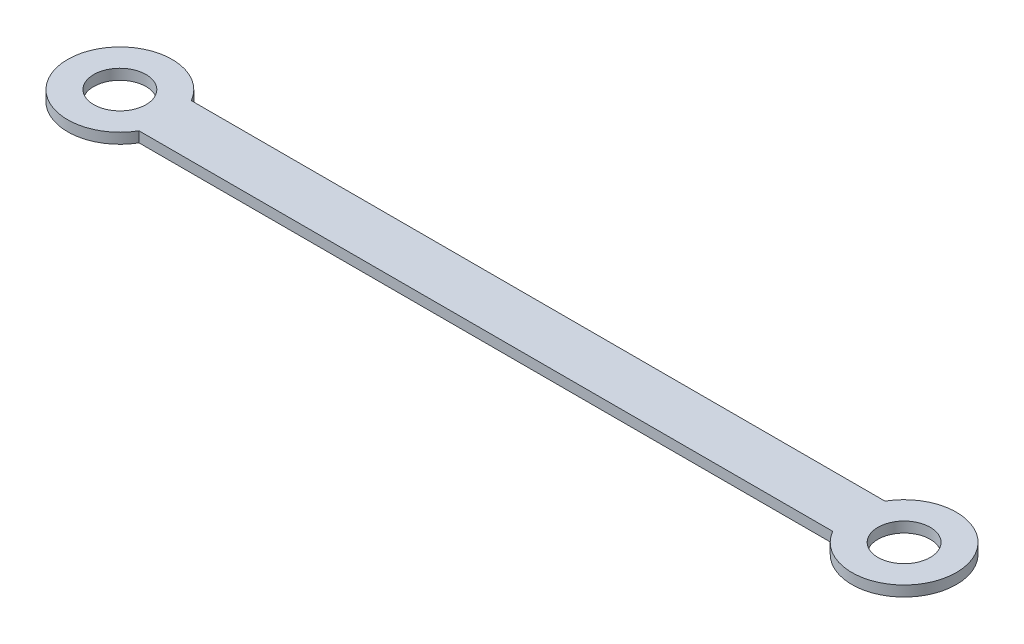
ISO-10303-21;
HEADER;
FILE_DESCRIPTION(('STEP AP214'),'2;1');
FILE_NAME('part.step','',(''),(''),'','','');
FILE_SCHEMA(('AUTOMOTIVE_DESIGN { 1 0 10303 214 1 1 1 1 }'));
ENDSEC;
DATA;
#1=APPLICATION_CONTEXT('core data for automotive mechanical design processes');
#2=APPLICATION_PROTOCOL_DEFINITION('international standard','automotive_design',2000,#1);
#3=PRODUCT_CONTEXT('',#1,'mechanical');
#4=PRODUCT('Part','Part','',(#3));
#5=PRODUCT_RELATED_PRODUCT_CATEGORY('part','',(#4));
#6=PRODUCT_DEFINITION_FORMATION('','',#4);
#7=PRODUCT_DEFINITION_CONTEXT('part definition',#1,'design');
#8=PRODUCT_DEFINITION('design','',#6,#7);
#9=PRODUCT_DEFINITION_SHAPE('','',#8);
#10=(LENGTH_UNIT() NAMED_UNIT(*) SI_UNIT(.MILLI.,.METRE.));
#11=(NAMED_UNIT(*) PLANE_ANGLE_UNIT() SI_UNIT($,.RADIAN.));
#12=(NAMED_UNIT(*) SI_UNIT($,.STERADIAN.) SOLID_ANGLE_UNIT());
#13=UNCERTAINTY_MEASURE_WITH_UNIT(LENGTH_MEASURE(1.E-05),#10,'distance_accuracy_value','');
#14=(GEOMETRIC_REPRESENTATION_CONTEXT(3) GLOBAL_UNCERTAINTY_ASSIGNED_CONTEXT((#13)) GLOBAL_UNIT_ASSIGNED_CONTEXT((#10,
#11,#12)) REPRESENTATION_CONTEXT('',''));
#15=CARTESIAN_POINT('',(0.,0.,0.));
#16=DIRECTION('',(0.,0.,1.));
#17=DIRECTION('',(1.,0.,0.));
#18=AXIS2_PLACEMENT_3D('',#15,#16,#17);
#19=CARTESIAN_POINT('',(150.,2.,0.));
#20=DIRECTION('',(0.,1.,0.));
#21=DIRECTION('',(0.,0.,1.));
#22=AXIS2_PLACEMENT_3D('',#19,#20,#21);
#23=PLANE('',#22);
#24=CARTESIAN_POINT('',(0.,2.,0.));
#25=DIRECTION('',(0.,1.,0.));
#26=DIRECTION('',(0.,0.,1.));
#27=AXIS2_PLACEMENT_3D('',#24,#25,#26);
#28=CIRCLE('',#27,5.);
#29=CARTESIAN_POINT('',(0.,2.,5.));
#30=VERTEX_POINT('',#29);
#31=EDGE_CURVE('E100',#30,#30,#28,.T.);
#32=ORIENTED_EDGE('',*,*,#31,.F.);
#33=EDGE_LOOP('',(#32));
#34=FACE_BOUND('',#33,.T.);
#35=CARTESIAN_POINT('',(150.,2.,0.));
#36=DIRECTION('',(0.,1.,0.));
#37=DIRECTION('',(0.,0.,1.));
#38=AXIS2_PLACEMENT_3D('',#35,#36,#37);
#39=CIRCLE('',#38,9.99999999999997);
#40=CARTESIAN_POINT('',(141.339745962156,2.,5.));
#41=VERTEX_POINT('',#40);
#42=CARTESIAN_POINT('',(141.339745962156,2.,-5.));
#43=VERTEX_POINT('',#42);
#44=EDGE_CURVE('E85',#41,#43,#39,.T.);
#45=ORIENTED_EDGE('',*,*,#44,.T.);
#46=DIRECTION('',(-1.,0.,0.));
#47=VECTOR('',#46,1.);
#48=CARTESIAN_POINT('',(141.339745962156,2.,-5.));
#49=LINE('',#48,#47);
#50=CARTESIAN_POINT('',(8.6602540378444,2.,-4.99999999999998));
#51=VERTEX_POINT('',#50);
#52=EDGE_CURVE('E80',#43,#51,#49,.T.);
#53=ORIENTED_EDGE('',*,*,#52,.T.);
#54=CARTESIAN_POINT('',(0.,2.,0.));
#55=DIRECTION('',(0.,1.,0.));
#56=DIRECTION('',(0.,0.,1.));
#57=AXIS2_PLACEMENT_3D('',#54,#55,#56);
#58=CIRCLE('',#57,10.);
#59=CARTESIAN_POINT('',(8.6602540378444,2.,4.99999999999998));
#60=VERTEX_POINT('',#59);
#61=EDGE_CURVE('E83',#51,#60,#58,.T.);
#62=ORIENTED_EDGE('',*,*,#61,.T.);
#63=DIRECTION('',(1.,0.,0.));
#64=VECTOR('',#63,1.);
#65=CARTESIAN_POINT('',(8.6602540378444,2.,4.99999999999998));
#66=LINE('',#65,#64);
#67=EDGE_CURVE('E50',#60,#41,#66,.T.);
#68=ORIENTED_EDGE('',*,*,#67,.T.);
#69=EDGE_LOOP('',(#45,#53,#62,#68));
#70=FACE_BOUND('',#69,.T.);
#71=CARTESIAN_POINT('',(150.,2.,0.));
#72=DIRECTION('',(0.,1.,0.));
#73=DIRECTION('',(0.,0.,1.));
#74=AXIS2_PLACEMENT_3D('',#71,#72,#73);
#75=CIRCLE('',#74,4.99999999999999);
#76=CARTESIAN_POINT('',(150.,2.,4.99999999999999));
#77=VERTEX_POINT('',#76);
#78=EDGE_CURVE('E115',#77,#77,#75,.T.);
#79=ORIENTED_EDGE('',*,*,#78,.F.);
#80=EDGE_LOOP('',(#79));
#81=FACE_BOUND('',#80,.T.);
#82=ADVANCED_FACE('F33',(#34,#70,#81),#23,.T.);
#83=CARTESIAN_POINT('',(150.,0.,0.));
#84=DIRECTION('',(0.,1.,0.));
#85=DIRECTION('',(0.,0.,1.));
#86=AXIS2_PLACEMENT_3D('',#83,#84,#85);
#87=PLANE('',#86);
#88=CARTESIAN_POINT('',(150.,0.,0.));
#89=DIRECTION('',(0.,1.,0.));
#90=DIRECTION('',(0.,0.,1.));
#91=AXIS2_PLACEMENT_3D('',#88,#89,#90);
#92=CIRCLE('',#91,9.99999999999997);
#93=CARTESIAN_POINT('',(141.339745962156,0.,5.));
#94=VERTEX_POINT('',#93);
#95=CARTESIAN_POINT('',(141.339745962156,0.,-5.));
#96=VERTEX_POINT('',#95);
#97=EDGE_CURVE('E97',#94,#96,#92,.T.);
#98=ORIENTED_EDGE('',*,*,#97,.F.);
#99=DIRECTION('',(1.,0.,0.));
#100=VECTOR('',#99,1.);
#101=CARTESIAN_POINT('',(8.6602540378444,0.,4.99999999999998));
#102=LINE('',#101,#100);
#103=CARTESIAN_POINT('',(8.6602540378444,0.,4.99999999999998));
#104=VERTEX_POINT('',#103);
#105=EDGE_CURVE('E73',#104,#94,#102,.T.);
#106=ORIENTED_EDGE('',*,*,#105,.F.);
#107=CARTESIAN_POINT('',(0.,0.,0.));
#108=DIRECTION('',(0.,1.,0.));
#109=DIRECTION('',(0.,0.,1.));
#110=AXIS2_PLACEMENT_3D('',#107,#108,#109);
#111=CIRCLE('',#110,10.);
#112=CARTESIAN_POINT('',(8.6602540378444,0.,-4.99999999999998));
#113=VERTEX_POINT('',#112);
#114=EDGE_CURVE('E67',#113,#104,#111,.T.);
#115=ORIENTED_EDGE('',*,*,#114,.F.);
#116=DIRECTION('',(-1.,0.,0.));
#117=VECTOR('',#116,1.);
#118=CARTESIAN_POINT('',(141.339745962156,0.,-5.));
#119=LINE('',#118,#117);
#120=EDGE_CURVE('E89',#96,#113,#119,.T.);
#121=ORIENTED_EDGE('',*,*,#120,.F.);
#122=EDGE_LOOP('',(#98,#106,#115,#121));
#123=FACE_BOUND('',#122,.T.);
#124=CARTESIAN_POINT('',(0.,0.,0.));
#125=DIRECTION('',(0.,1.,0.));
#126=DIRECTION('',(0.,0.,1.));
#127=AXIS2_PLACEMENT_3D('',#124,#125,#126);
#128=CIRCLE('',#127,5.);
#129=CARTESIAN_POINT('',(0.,0.,5.));
#130=VERTEX_POINT('',#129);
#131=EDGE_CURVE('E112',#130,#130,#128,.T.);
#132=ORIENTED_EDGE('',*,*,#131,.T.);
#133=EDGE_LOOP('',(#132));
#134=FACE_BOUND('',#133,.T.);
#135=CARTESIAN_POINT('',(150.,0.,0.));
#136=DIRECTION('',(0.,1.,0.));
#137=DIRECTION('',(0.,0.,1.));
#138=AXIS2_PLACEMENT_3D('',#135,#136,#137);
#139=CIRCLE('',#138,4.99999999999999);
#140=CARTESIAN_POINT('',(150.,0.,4.99999999999999));
#141=VERTEX_POINT('',#140);
#142=EDGE_CURVE('E118',#141,#141,#139,.T.);
#143=ORIENTED_EDGE('',*,*,#142,.T.);
#144=EDGE_LOOP('',(#143));
#145=FACE_BOUND('',#144,.T.);
#146=ADVANCED_FACE('F108',(#123,#134,#145),#87,.F.);
#147=CARTESIAN_POINT('',(150.,2.,0.));
#148=DIRECTION('',(0.,-1.,0.));
#149=DIRECTION('',(0.,0.,-1.));
#150=AXIS2_PLACEMENT_3D('',#147,#148,#149);
#151=CYLINDRICAL_SURFACE('',#150,9.99999999999997);
#152=ORIENTED_EDGE('',*,*,#97,.T.);
#153=DIRECTION('',(0.,-1.,0.));
#154=VECTOR('',#153,1.);
#155=CARTESIAN_POINT('',(141.339745962156,2.,-5.));
#156=LINE('',#155,#154);
#157=EDGE_CURVE('E11',#43,#96,#156,.T.);
#158=ORIENTED_EDGE('',*,*,#157,.F.);
#159=ORIENTED_EDGE('',*,*,#44,.F.);
#160=DIRECTION('',(0.,-1.,0.));
#161=VECTOR('',#160,1.);
#162=CARTESIAN_POINT('',(141.339745962156,2.,5.));
#163=LINE('',#162,#161);
#164=EDGE_CURVE('E93',#41,#94,#163,.T.);
#165=ORIENTED_EDGE('',*,*,#164,.T.);
#166=EDGE_LOOP('',(#152,#158,#159,#165));
#167=FACE_BOUND('',#166,.T.);
#168=ADVANCED_FACE('F35',(#167),#151,.T.);
#169=CARTESIAN_POINT('',(141.339745962156,2.,-5.));
#170=DIRECTION('',(0.,0.,1.));
#171=DIRECTION('',(1.,0.,0.));
#172=AXIS2_PLACEMENT_3D('',#169,#170,#171);
#173=PLANE('',#172);
#174=ORIENTED_EDGE('',*,*,#120,.T.);
#175=DIRECTION('',(0.,-1.,0.));
#176=VECTOR('',#175,1.);
#177=CARTESIAN_POINT('',(8.6602540378444,2.,-4.99999999999998));
#178=LINE('',#177,#176);
#179=EDGE_CURVE('E42',#51,#113,#178,.T.);
#180=ORIENTED_EDGE('',*,*,#179,.F.);
#181=ORIENTED_EDGE('',*,*,#52,.F.);
#182=ORIENTED_EDGE('',*,*,#157,.T.);
#183=EDGE_LOOP('',(#174,#180,#181,#182));
#184=FACE_BOUND('',#183,.T.);
#185=ADVANCED_FACE('F88',(#184),#173,.F.);
#186=CARTESIAN_POINT('',(0.,2.,0.));
#187=DIRECTION('',(0.,-1.,0.));
#188=DIRECTION('',(0.,0.,-1.));
#189=AXIS2_PLACEMENT_3D('',#186,#187,#188);
#190=CYLINDRICAL_SURFACE('',#189,10.);
#191=ORIENTED_EDGE('',*,*,#114,.T.);
#192=DIRECTION('',(0.,-1.,0.));
#193=VECTOR('',#192,1.);
#194=CARTESIAN_POINT('',(8.6602540378444,2.,4.99999999999998));
#195=LINE('',#194,#193);
#196=EDGE_CURVE('E90',#60,#104,#195,.T.);
#197=ORIENTED_EDGE('',*,*,#196,.F.);
#198=ORIENTED_EDGE('',*,*,#61,.F.);
#199=ORIENTED_EDGE('',*,*,#179,.T.);
#200=EDGE_LOOP('',(#191,#197,#198,#199));
#201=FACE_BOUND('',#200,.T.);
#202=ADVANCED_FACE('F91',(#201),#190,.T.);
#203=CARTESIAN_POINT('',(8.6602540378444,2.,4.99999999999998));
#204=DIRECTION('',(0.,0.,-1.));
#205=DIRECTION('',(-1.,0.,0.));
#206=AXIS2_PLACEMENT_3D('',#203,#204,#205);
#207=PLANE('',#206);
#208=ORIENTED_EDGE('',*,*,#105,.T.);
#209=ORIENTED_EDGE('',*,*,#164,.F.);
#210=ORIENTED_EDGE('',*,*,#67,.F.);
#211=ORIENTED_EDGE('',*,*,#196,.T.);
#212=EDGE_LOOP('',(#208,#209,#210,#211));
#213=FACE_BOUND('',#212,.T.);
#214=ADVANCED_FACE('F105',(#213),#207,.F.);
#215=CARTESIAN_POINT('',(0.,2.,0.));
#216=DIRECTION('',(0.,-1.,0.));
#217=DIRECTION('',(0.,0.,-1.));
#218=AXIS2_PLACEMENT_3D('',#215,#216,#217);
#219=CYLINDRICAL_SURFACE('',#218,5.);
#220=ORIENTED_EDGE('',*,*,#31,.T.);
#221=EDGE_LOOP('',(#220));
#222=FACE_BOUND('',#221,.T.);
#223=ORIENTED_EDGE('',*,*,#131,.F.);
#224=EDGE_LOOP('',(#223));
#225=FACE_BOUND('',#224,.T.);
#226=ADVANCED_FACE('F135',(#222,#225),#219,.F.);
#227=CARTESIAN_POINT('',(150.,2.,0.));
#228=DIRECTION('',(0.,-1.,0.));
#229=DIRECTION('',(0.,0.,-1.));
#230=AXIS2_PLACEMENT_3D('',#227,#228,#229);
#231=CYLINDRICAL_SURFACE('',#230,4.99999999999999);
#232=ORIENTED_EDGE('',*,*,#78,.T.);
#233=EDGE_LOOP('',(#232));
#234=FACE_BOUND('',#233,.T.);
#235=ORIENTED_EDGE('',*,*,#142,.F.);
#236=EDGE_LOOP('',(#235));
#237=FACE_BOUND('',#236,.T.);
#238=ADVANCED_FACE('F124',(#234,#237),#231,.F.);
#239=CLOSED_SHELL('',(#82,#146,#168,#185,#202,#214,#226,#238));
#240=MANIFOLD_SOLID_BREP('B2',#239);
#241=ADVANCED_BREP_SHAPE_REPRESENTATION('',(#18,#240),#14);
#242=SHAPE_DEFINITION_REPRESENTATION(#9,#241);
ENDSEC;
END-ISO-10303-21;
